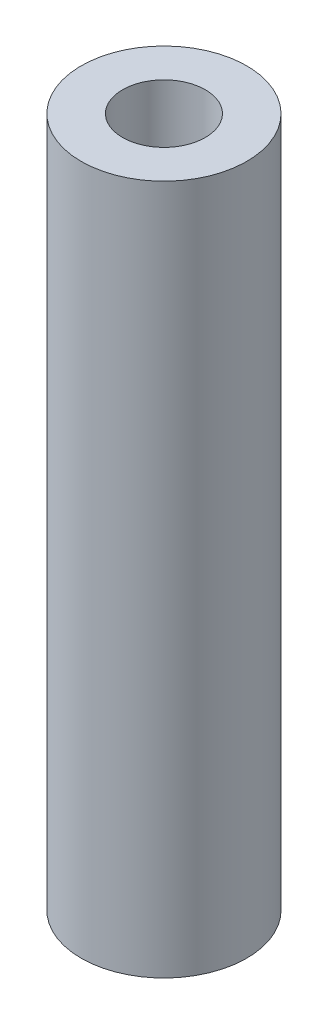
ISO-10303-21;
HEADER;
FILE_DESCRIPTION(('STEP AP214'),'2;1');
FILE_NAME('part.step','',(''),(''),'','','');
FILE_SCHEMA(('AUTOMOTIVE_DESIGN { 1 0 10303 214 1 1 1 1 }'));
ENDSEC;
DATA;
#1=APPLICATION_CONTEXT('core data for automotive mechanical design processes');
#2=APPLICATION_PROTOCOL_DEFINITION('international standard','automotive_design',2000,#1);
#3=PRODUCT_CONTEXT('',#1,'mechanical');
#4=PRODUCT('Part','Part','',(#3));
#5=PRODUCT_RELATED_PRODUCT_CATEGORY('part','',(#4));
#6=PRODUCT_DEFINITION_FORMATION('','',#4);
#7=PRODUCT_DEFINITION_CONTEXT('part definition',#1,'design');
#8=PRODUCT_DEFINITION('design','',#6,#7);
#9=PRODUCT_DEFINITION_SHAPE('','',#8);
#10=(LENGTH_UNIT() NAMED_UNIT(*) SI_UNIT(.MILLI.,.METRE.));
#11=(NAMED_UNIT(*) PLANE_ANGLE_UNIT() SI_UNIT($,.RADIAN.));
#12=(NAMED_UNIT(*) SI_UNIT($,.STERADIAN.) SOLID_ANGLE_UNIT());
#13=UNCERTAINTY_MEASURE_WITH_UNIT(LENGTH_MEASURE(1.E-05),#10,'distance_accuracy_value','');
#14=(GEOMETRIC_REPRESENTATION_CONTEXT(3) GLOBAL_UNCERTAINTY_ASSIGNED_CONTEXT((#13)) GLOBAL_UNIT_ASSIGNED_CONTEXT((#10,
#11,#12)) REPRESENTATION_CONTEXT('',''));
#15=CARTESIAN_POINT('',(0.,0.,0.));
#16=DIRECTION('',(0.,0.,1.));
#17=DIRECTION('',(1.,0.,0.));
#18=AXIS2_PLACEMENT_3D('',#15,#16,#17);
#19=CARTESIAN_POINT('',(0.,25.,0.));
#20=DIRECTION('',(0.,1.,0.));
#21=DIRECTION('',(0.,0.,1.));
#22=AXIS2_PLACEMENT_3D('',#19,#20,#21);
#23=PLANE('',#22);
#24=CARTESIAN_POINT('',(0.,25.,0.));
#25=DIRECTION('',(0.,1.,0.));
#26=DIRECTION('',(0.,0.,1.));
#27=AXIS2_PLACEMENT_3D('',#24,#25,#26);
#28=CIRCLE('',#27,3.);
#29=CARTESIAN_POINT('',(0.,25.,3.));
#30=VERTEX_POINT('',#29);
#31=EDGE_CURVE('E10',#30,#30,#28,.T.);
#32=ORIENTED_EDGE('',*,*,#31,.T.);
#33=EDGE_LOOP('',(#32));
#34=FACE_BOUND('',#33,.T.);
#35=CARTESIAN_POINT('',(0.,25.,0.));
#36=DIRECTION('',(0.,1.,0.));
#37=DIRECTION('',(0.,0.,1.));
#38=AXIS2_PLACEMENT_3D('',#35,#36,#37);
#39=CIRCLE('',#38,1.5);
#40=CARTESIAN_POINT('',(0.,25.,1.5));
#41=VERTEX_POINT('',#40);
#42=EDGE_CURVE('E42',#41,#41,#39,.T.);
#43=ORIENTED_EDGE('',*,*,#42,.F.);
#44=EDGE_LOOP('',(#43));
#45=FACE_BOUND('',#44,.T.);
#46=ADVANCED_FACE('F31',(#34,#45),#23,.T.);
#47=CARTESIAN_POINT('',(0.,0.,0.));
#48=DIRECTION('',(0.,1.,0.));
#49=DIRECTION('',(0.,0.,1.));
#50=AXIS2_PLACEMENT_3D('',#47,#48,#49);
#51=PLANE('',#50);
#52=CARTESIAN_POINT('',(0.,0.,0.));
#53=DIRECTION('',(0.,1.,0.));
#54=DIRECTION('',(0.,0.,1.));
#55=AXIS2_PLACEMENT_3D('',#52,#53,#54);
#56=CIRCLE('',#55,3.);
#57=CARTESIAN_POINT('',(0.,0.,3.));
#58=VERTEX_POINT('',#57);
#59=EDGE_CURVE('E35',#58,#58,#56,.T.);
#60=ORIENTED_EDGE('',*,*,#59,.F.);
#61=EDGE_LOOP('',(#60));
#62=FACE_BOUND('',#61,.T.);
#63=CARTESIAN_POINT('',(0.,0.,0.));
#64=DIRECTION('',(0.,1.,0.));
#65=DIRECTION('',(0.,0.,1.));
#66=AXIS2_PLACEMENT_3D('',#63,#64,#65);
#67=CIRCLE('',#66,1.5);
#68=CARTESIAN_POINT('',(0.,0.,1.5));
#69=VERTEX_POINT('',#68);
#70=EDGE_CURVE('E44',#69,#69,#67,.T.);
#71=ORIENTED_EDGE('',*,*,#70,.T.);
#72=EDGE_LOOP('',(#71));
#73=FACE_BOUND('',#72,.T.);
#74=ADVANCED_FACE('F54',(#62,#73),#51,.F.);
#75=CARTESIAN_POINT('',(0.,25.,0.));
#76=DIRECTION('',(0.,-1.,0.));
#77=DIRECTION('',(0.,0.,-1.));
#78=AXIS2_PLACEMENT_3D('',#75,#76,#77);
#79=CYLINDRICAL_SURFACE('',#78,3.);
#80=ORIENTED_EDGE('',*,*,#31,.F.);
#81=EDGE_LOOP('',(#80));
#82=FACE_BOUND('',#81,.T.);
#83=ORIENTED_EDGE('',*,*,#59,.T.);
#84=EDGE_LOOP('',(#83));
#85=FACE_BOUND('',#84,.T.);
#86=ADVANCED_FACE('F33',(#82,#85),#79,.T.);
#87=CARTESIAN_POINT('',(0.,25.,0.));
#88=DIRECTION('',(0.,-1.,0.));
#89=DIRECTION('',(0.,0.,-1.));
#90=AXIS2_PLACEMENT_3D('',#87,#88,#89);
#91=CYLINDRICAL_SURFACE('',#90,1.5);
#92=ORIENTED_EDGE('',*,*,#42,.T.);
#93=EDGE_LOOP('',(#92));
#94=FACE_BOUND('',#93,.T.);
#95=ORIENTED_EDGE('',*,*,#70,.F.);
#96=EDGE_LOOP('',(#95));
#97=FACE_BOUND('',#96,.T.);
#98=ADVANCED_FACE('F50',(#94,#97),#91,.F.);
#99=CLOSED_SHELL('',(#46,#74,#86,#98));
#100=MANIFOLD_SOLID_BREP('B2',#99);
#101=ADVANCED_BREP_SHAPE_REPRESENTATION('',(#18,#100),#14);
#102=SHAPE_DEFINITION_REPRESENTATION(#9,#101);
ENDSEC;
END-ISO-10303-21;
